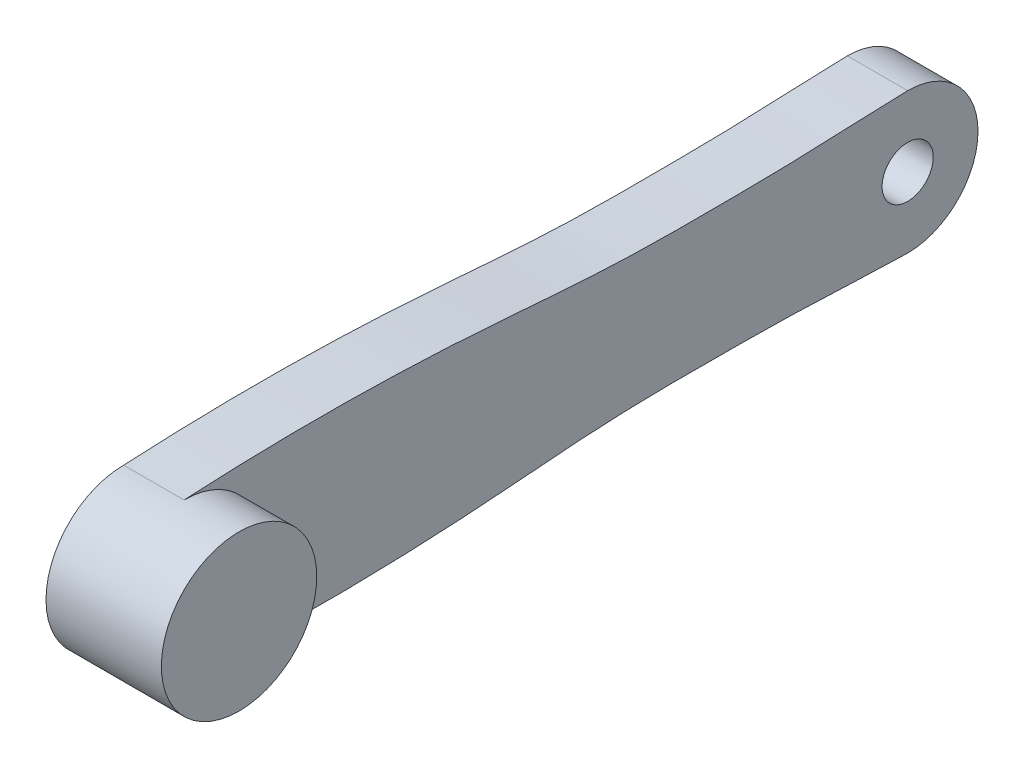
ISO-10303-21;
HEADER;
FILE_DESCRIPTION(('STEP AP214'),'2;1');
FILE_NAME('part.step','',(''),(''),'','','');
FILE_SCHEMA(('AUTOMOTIVE_DESIGN { 1 0 10303 214 1 1 1 1 }'));
ENDSEC;
DATA;
#1=APPLICATION_CONTEXT('core data for automotive mechanical design processes');
#2=APPLICATION_PROTOCOL_DEFINITION('international standard','automotive_design',2000,#1);
#3=PRODUCT_CONTEXT('',#1,'mechanical');
#4=PRODUCT('Part','Part','',(#3));
#5=PRODUCT_RELATED_PRODUCT_CATEGORY('part','',(#4));
#6=PRODUCT_DEFINITION_FORMATION('','',#4);
#7=PRODUCT_DEFINITION_CONTEXT('part definition',#1,'design');
#8=PRODUCT_DEFINITION('design','',#6,#7);
#9=PRODUCT_DEFINITION_SHAPE('','',#8);
#10=(LENGTH_UNIT() NAMED_UNIT(*) SI_UNIT(.MILLI.,.METRE.));
#11=(NAMED_UNIT(*) PLANE_ANGLE_UNIT() SI_UNIT($,.RADIAN.));
#12=(NAMED_UNIT(*) SI_UNIT($,.STERADIAN.) SOLID_ANGLE_UNIT());
#13=UNCERTAINTY_MEASURE_WITH_UNIT(LENGTH_MEASURE(1.E-05),#10,'distance_accuracy_value','');
#14=(GEOMETRIC_REPRESENTATION_CONTEXT(3) GLOBAL_UNCERTAINTY_ASSIGNED_CONTEXT((#13)) GLOBAL_UNIT_ASSIGNED_CONTEXT((#10,
#11,#12)) REPRESENTATION_CONTEXT('',''));
#15=CARTESIAN_POINT('',(0.,0.,0.));
#16=DIRECTION('',(0.,0.,1.));
#17=DIRECTION('',(1.,0.,0.));
#18=AXIS2_PLACEMENT_3D('',#15,#16,#17);
#19=CARTESIAN_POINT('',(0.,0.,-169.75));
#20=DIRECTION('',(-1.,0.,0.));
#21=DIRECTION('',(0.,0.,1.));
#22=AXIS2_PLACEMENT_3D('',#19,#20,#21);
#23=CYLINDRICAL_SURFACE('',#22,5.99999999999999);
#24=CARTESIAN_POINT('',(14.15,0.,-169.75));
#25=DIRECTION('',(-1.,0.,0.));
#26=DIRECTION('',(0.,0.,1.));
#27=AXIS2_PLACEMENT_3D('',#24,#25,#26);
#28=CIRCLE('',#27,5.99999999999999);
#29=CARTESIAN_POINT('',(14.15,0.,-163.75));
#30=VERTEX_POINT('',#29);
#31=EDGE_CURVE('E144',#30,#30,#28,.T.);
#32=ORIENTED_EDGE('',*,*,#31,.F.);
#33=EDGE_LOOP('',(#32));
#34=FACE_BOUND('',#33,.T.);
#35=CARTESIAN_POINT('',(2.5,0.,-169.75));
#36=DIRECTION('',(-1.,0.,0.));
#37=DIRECTION('',(0.,0.,1.));
#38=AXIS2_PLACEMENT_3D('',#35,#36,#37);
#39=CIRCLE('',#38,5.99999999999999);
#40=CARTESIAN_POINT('',(2.5,0.,-163.75));
#41=VERTEX_POINT('',#40);
#42=EDGE_CURVE('E40',#41,#41,#39,.F.);
#43=ORIENTED_EDGE('',*,*,#42,.F.);
#44=EDGE_LOOP('',(#43));
#45=FACE_BOUND('',#44,.T.);
#46=ADVANCED_FACE('F36',(#34,#45),#23,.F.);
#47=CARTESIAN_POINT('',(27.06,0.,0.));
#48=DIRECTION('',(-1.,0.,0.));
#49=DIRECTION('',(0.,0.,1.));
#50=AXIS2_PLACEMENT_3D('',#47,#48,#49);
#51=CYLINDRICAL_SURFACE('',#50,18.225);
#52=CARTESIAN_POINT('',(27.06,0.,0.));
#53=DIRECTION('',(1.,0.,0.));
#54=DIRECTION('',(0.,0.,-1.));
#55=AXIS2_PLACEMENT_3D('',#52,#53,#54);
#56=CIRCLE('',#55,18.225);
#57=CARTESIAN_POINT('',(27.06,0.,-18.225));
#58=VERTEX_POINT('',#57);
#59=EDGE_CURVE('E11',#58,#58,#56,.T.);
#60=ORIENTED_EDGE('',*,*,#59,.F.);
#61=EDGE_LOOP('',(#60));
#62=FACE_BOUND('',#61,.T.);
#63=CARTESIAN_POINT('',(14.15,0.,0.));
#64=DIRECTION('',(1.,0.,0.));
#65=DIRECTION('',(0.,0.,1.));
#66=AXIS2_PLACEMENT_3D('',#63,#64,#65);
#67=CIRCLE('',#66,18.225);
#68=CARTESIAN_POINT('',(14.15,-18.225,0.));
#69=VERTEX_POINT('',#68);
#70=CARTESIAN_POINT('',(14.15,18.225,-1.11013353549737E-09));
#71=VERTEX_POINT('',#70);
#72=EDGE_CURVE('E58',#69,#71,#67,.T.);
#73=ORIENTED_EDGE('',*,*,#72,.T.);
#74=DIRECTION('',(-1.,0.,0.));
#75=VECTOR('',#74,1.);
#76=CARTESIAN_POINT('',(14.15,18.225,-1.11013926366381E-09));
#77=LINE('',#76,#75);
#78=CARTESIAN_POINT('',(0.,18.225,-1.11013926366381E-09));
#79=VERTEX_POINT('',#78);
#80=EDGE_CURVE('E135',#71,#79,#77,.T.);
#81=ORIENTED_EDGE('',*,*,#80,.T.);
#82=CARTESIAN_POINT('',(0.,0.,0.));
#83=DIRECTION('',(1.,0.,0.));
#84=DIRECTION('',(0.,0.,-1.));
#85=AXIS2_PLACEMENT_3D('',#82,#83,#84);
#86=CIRCLE('',#85,18.225);
#87=CARTESIAN_POINT('',(0.,-18.225,0.));
#88=VERTEX_POINT('',#87);
#89=EDGE_CURVE('E45',#79,#88,#86,.T.);
#90=ORIENTED_EDGE('',*,*,#89,.T.);
#91=DIRECTION('',(-1.,0.,0.));
#92=VECTOR('',#91,1.);
#93=CARTESIAN_POINT('',(14.15,-18.225,0.));
#94=LINE('',#93,#92);
#95=EDGE_CURVE('E53',#69,#88,#94,.T.);
#96=ORIENTED_EDGE('',*,*,#95,.F.);
#97=EDGE_LOOP('',(#73,#81,#90,#96));
#98=FACE_BOUND('',#97,.T.);
#99=ADVANCED_FACE('F38',(#62,#98),#51,.T.);
#100=CARTESIAN_POINT('',(27.06,0.,0.));
#101=DIRECTION('',(1.,0.,0.));
#102=DIRECTION('',(0.,0.,-1.));
#103=AXIS2_PLACEMENT_3D('',#100,#101,#102);
#104=PLANE('',#103);
#105=ORIENTED_EDGE('',*,*,#59,.T.);
#106=EDGE_LOOP('',(#105));
#107=FACE_BOUND('',#106,.T.);
#108=ADVANCED_FACE('F185',(#107),#104,.T.);
#109=CARTESIAN_POINT('',(0.,0.,0.));
#110=DIRECTION('',(1.,0.,0.));
#111=DIRECTION('',(0.,0.,-1.));
#112=AXIS2_PLACEMENT_3D('',#109,#110,#111);
#113=PLANE('',#112);
#114=CARTESIAN_POINT('',(0.,0.,-169.75));
#115=DIRECTION('',(-1.,0.,0.));
#116=DIRECTION('',(0.,0.,1.));
#117=AXIS2_PLACEMENT_3D('',#114,#115,#116);
#118=CIRCLE('',#117,10.);
#119=CARTESIAN_POINT('',(0.,0.,-159.75));
#120=VERTEX_POINT('',#119);
#121=EDGE_CURVE('E303',#120,#120,#118,.T.);
#122=ORIENTED_EDGE('',*,*,#121,.F.);
#123=EDGE_LOOP('',(#122));
#124=FACE_BOUND('',#123,.T.);
#125=DIRECTION('',(0.,0.866025403784438,-0.5));
#126=VECTOR('',#125,1.);
#127=CARTESIAN_POINT('',(0.,0.,4.61880215351701));
#128=LINE('',#127,#126);
#129=CARTESIAN_POINT('',(0.,0.,4.61880215351701));
#130=VERTEX_POINT('',#129);
#131=CARTESIAN_POINT('',(0.,4.,2.3094010767585));
#132=VERTEX_POINT('',#131);
#133=EDGE_CURVE('E258',#130,#132,#128,.T.);
#134=ORIENTED_EDGE('',*,*,#133,.F.);
#135=DIRECTION('',(0.,0.866025403784439,0.5));
#136=VECTOR('',#135,1.);
#137=CARTESIAN_POINT('',(0.,-4.,2.3094010767585));
#138=LINE('',#137,#136);
#139=CARTESIAN_POINT('',(0.,-4.,2.3094010767585));
#140=VERTEX_POINT('',#139);
#141=EDGE_CURVE('E234',#140,#130,#138,.T.);
#142=ORIENTED_EDGE('',*,*,#141,.F.);
#143=DIRECTION('',(0.,0.,1.));
#144=VECTOR('',#143,1.);
#145=CARTESIAN_POINT('',(0.,-4.,-2.3094010767585));
#146=LINE('',#145,#144);
#147=CARTESIAN_POINT('',(0.,-4.,-2.3094010767585));
#148=VERTEX_POINT('',#147);
#149=EDGE_CURVE('E241',#148,#140,#146,.T.);
#150=ORIENTED_EDGE('',*,*,#149,.F.);
#151=DIRECTION('',(0.,-0.866025403784439,0.5));
#152=VECTOR('',#151,1.);
#153=CARTESIAN_POINT('',(0.,0.,-4.61880215351701));
#154=LINE('',#153,#152);
#155=CARTESIAN_POINT('',(0.,0.,-4.61880215351701));
#156=VERTEX_POINT('',#155);
#157=EDGE_CURVE('E267',#156,#148,#154,.T.);
#158=ORIENTED_EDGE('',*,*,#157,.F.);
#159=DIRECTION('',(0.,-0.866025403784439,-0.5));
#160=VECTOR('',#159,1.);
#161=CARTESIAN_POINT('',(0.,4.,-2.3094010767585));
#162=LINE('',#161,#160);
#163=CARTESIAN_POINT('',(0.,4.,-2.3094010767585));
#164=VERTEX_POINT('',#163);
#165=EDGE_CURVE('E264',#164,#156,#162,.T.);
#166=ORIENTED_EDGE('',*,*,#165,.F.);
#167=DIRECTION('',(0.,0.,-1.));
#168=VECTOR('',#167,1.);
#169=CARTESIAN_POINT('',(0.,4.,2.3094010767585));
#170=LINE('',#169,#168);
#171=EDGE_CURVE('E261',#132,#164,#170,.T.);
#172=ORIENTED_EDGE('',*,*,#171,.F.);
#173=EDGE_LOOP('',(#134,#142,#150,#158,#166,#172));
#174=FACE_BOUND('',#173,.T.);
#175=ORIENTED_EDGE('',*,*,#89,.F.);
#176=CARTESIAN_POINT('',(0.,18.225,-1.11013353549737E-09));
#177=CARTESIAN_POINT('',(0.,19.4874620186553,-23.2342693919419));
#178=CARTESIAN_POINT('',(0.,19.3330443565488,-56.5827604293317));
#179=CARTESIAN_POINT('',(0.,15.1468255186927,-99.7009370042646));
#180=CARTESIAN_POINT('',(0.,15.2407955833878,-123.084465671128));
#181=CARTESIAN_POINT('',(0.,15.4354663481788,-146.423041336121));
#182=CARTESIAN_POINT('',(0.,16.2703476300834,-159.749007011093));
#183=CARTESIAN_POINT('',(0.,16.5,-169.74999999889));
#184=B_SPLINE_CURVE_WITH_KNOTS('',3,(#176,#177,#178,#179,#180,#181,#182,#183),.UNSPECIFIED.,.F.,
.F.,(4,1,1,1,1,4),(0.,0.410781152391719,0.587817397240798,0.764423196787174,0.823292389326406,
1.),.UNSPECIFIED.);
#185=CARTESIAN_POINT('',(0.,16.5,-169.74999999889));
#186=VERTEX_POINT('',#185);
#187=EDGE_CURVE('E220',#79,#186,#184,.T.);
#188=ORIENTED_EDGE('',*,*,#187,.T.);
#189=CARTESIAN_POINT('',(0.,0.,-169.75));
#190=DIRECTION('',(-1.,0.,0.));
#191=DIRECTION('',(0.,0.,1.));
#192=AXIS2_PLACEMENT_3D('',#189,#190,#191);
#193=CIRCLE('',#192,16.5);
#194=CARTESIAN_POINT('',(0.,-16.5,-169.75));
#195=VERTEX_POINT('',#194);
#196=EDGE_CURVE('E120',#186,#195,#193,.T.);
#197=ORIENTED_EDGE('',*,*,#196,.T.);
#198=CARTESIAN_POINT('',(0.,-16.5,-169.75));
#199=CARTESIAN_POINT('',(0.,-16.270347630133,-159.749007011831));
#200=CARTESIAN_POINT('',(0.,-15.4354663481814,-146.423041336491));
#201=CARTESIAN_POINT('',(0.,-15.2407955833881,-123.084465671128));
#202=CARTESIAN_POINT('',(0.,-15.1468255186922,-99.7009370042646));
#203=CARTESIAN_POINT('',(0.,-19.3330443565871,-56.582760428963));
#204=CARTESIAN_POINT('',(0.,-19.4874620186463,-23.2342693912009));
#205=CARTESIAN_POINT('',(0.,-18.225,0.));
#206=B_SPLINE_CURVE_WITH_KNOTS('',3,(#198,#199,#200,#201,#202,#203,#204,#205),.UNSPECIFIED.,.F.,
.F.,(4,1,1,1,1,4),(0.,0.176707610677815,0.235576803216278,0.412182602760347,0.589218847607113,
1.),.UNSPECIFIED.);
#207=EDGE_CURVE('E136',#195,#88,#206,.T.);
#208=ORIENTED_EDGE('',*,*,#207,.T.);
#209=EDGE_LOOP('',(#175,#188,#197,#208));
#210=FACE_BOUND('',#209,.T.);
#211=ADVANCED_FACE('F183',(#124,#174,#210),#113,.F.);
#212=CARTESIAN_POINT('',(5.8,-4.,2.3094010767585));
#213=DIRECTION('',(0.,-0.5,0.866025403784439));
#214=DIRECTION('',(0.,-0.866025403784439,-0.5));
#215=AXIS2_PLACEMENT_3D('',#212,#213,#214);
#216=PLANE('',#215);
#217=ORIENTED_EDGE('',*,*,#141,.T.);
#218=DIRECTION('',(-1.,0.,0.));
#219=VECTOR('',#218,1.);
#220=CARTESIAN_POINT('',(5.8,0.,4.61880215351701));
#221=LINE('',#220,#219);
#222=CARTESIAN_POINT('',(5.8,0.,4.61880215351701));
#223=VERTEX_POINT('',#222);
#224=EDGE_CURVE('E256',#223,#130,#221,.T.);
#225=ORIENTED_EDGE('',*,*,#224,.F.);
#226=DIRECTION('',(0.,0.866025403784439,0.5));
#227=VECTOR('',#226,1.);
#228=CARTESIAN_POINT('',(5.8,-4.,2.3094010767585));
#229=LINE('',#228,#227);
#230=CARTESIAN_POINT('',(5.8,-4.,2.3094010767585));
#231=VERTEX_POINT('',#230);
#232=EDGE_CURVE('E237',#231,#223,#229,.T.);
#233=ORIENTED_EDGE('',*,*,#232,.F.);
#234=DIRECTION('',(-1.,0.,0.));
#235=VECTOR('',#234,1.);
#236=CARTESIAN_POINT('',(5.8,-4.,2.3094010767585));
#237=LINE('',#236,#235);
#238=EDGE_CURVE('E272',#231,#140,#237,.T.);
#239=ORIENTED_EDGE('',*,*,#238,.T.);
#240=EDGE_LOOP('',(#217,#225,#233,#239));
#241=FACE_BOUND('',#240,.T.);
#242=ADVANCED_FACE('F165',(#241),#216,.F.);
#243=CARTESIAN_POINT('',(5.8,-4.,-2.3094010767585));
#244=DIRECTION('',(0.,-1.,0.));
#245=DIRECTION('',(0.,0.,-1.));
#246=AXIS2_PLACEMENT_3D('',#243,#244,#245);
#247=PLANE('',#246);
#248=ORIENTED_EDGE('',*,*,#149,.T.);
#249=ORIENTED_EDGE('',*,*,#238,.F.);
#250=DIRECTION('',(0.,0.,1.));
#251=VECTOR('',#250,1.);
#252=CARTESIAN_POINT('',(5.8,-4.,-2.3094010767585));
#253=LINE('',#252,#251);
#254=CARTESIAN_POINT('',(5.8,-4.,-2.3094010767585));
#255=VERTEX_POINT('',#254);
#256=EDGE_CURVE('E253',#255,#231,#253,.T.);
#257=ORIENTED_EDGE('',*,*,#256,.F.);
#258=DIRECTION('',(-1.,0.,0.));
#259=VECTOR('',#258,1.);
#260=CARTESIAN_POINT('',(5.8,-4.,-2.3094010767585));
#261=LINE('',#260,#259);
#262=EDGE_CURVE('E274',#255,#148,#261,.T.);
#263=ORIENTED_EDGE('',*,*,#262,.T.);
#264=EDGE_LOOP('',(#248,#249,#257,#263));
#265=FACE_BOUND('',#264,.T.);
#266=ADVANCED_FACE('F161',(#265),#247,.F.);
#267=CARTESIAN_POINT('',(5.8,0.,-4.61880215351701));
#268=DIRECTION('',(0.,-0.5,-0.866025403784439));
#269=DIRECTION('',(0.,0.866025403784439,-0.5));
#270=AXIS2_PLACEMENT_3D('',#267,#268,#269);
#271=PLANE('',#270);
#272=ORIENTED_EDGE('',*,*,#157,.T.);
#273=ORIENTED_EDGE('',*,*,#262,.F.);
#274=DIRECTION('',(0.,-0.866025403784439,0.5));
#275=VECTOR('',#274,1.);
#276=CARTESIAN_POINT('',(5.8,0.,-4.61880215351701));
#277=LINE('',#276,#275);
#278=CARTESIAN_POINT('',(5.8,0.,-4.61880215351701));
#279=VERTEX_POINT('',#278);
#280=EDGE_CURVE('E250',#279,#255,#277,.T.);
#281=ORIENTED_EDGE('',*,*,#280,.F.);
#282=DIRECTION('',(-1.,0.,0.));
#283=VECTOR('',#282,1.);
#284=CARTESIAN_POINT('',(5.8,0.,-4.61880215351701));
#285=LINE('',#284,#283);
#286=EDGE_CURVE('E276',#279,#156,#285,.T.);
#287=ORIENTED_EDGE('',*,*,#286,.T.);
#288=EDGE_LOOP('',(#272,#273,#281,#287));
#289=FACE_BOUND('',#288,.T.);
#290=ADVANCED_FACE('F164',(#289),#271,.F.);
#291=CARTESIAN_POINT('',(5.8,4.,-2.3094010767585));
#292=DIRECTION('',(0.,0.5,-0.866025403784439));
#293=DIRECTION('',(0.,0.866025403784439,0.5));
#294=AXIS2_PLACEMENT_3D('',#291,#292,#293);
#295=PLANE('',#294);
#296=ORIENTED_EDGE('',*,*,#165,.T.);
#297=ORIENTED_EDGE('',*,*,#286,.F.);
#298=DIRECTION('',(0.,-0.866025403784439,-0.5));
#299=VECTOR('',#298,1.);
#300=CARTESIAN_POINT('',(5.8,4.,-2.3094010767585));
#301=LINE('',#300,#299);
#302=CARTESIAN_POINT('',(5.8,4.,-2.3094010767585));
#303=VERTEX_POINT('',#302);
#304=EDGE_CURVE('E247',#303,#279,#301,.T.);
#305=ORIENTED_EDGE('',*,*,#304,.F.);
#306=DIRECTION('',(-1.,0.,0.));
#307=VECTOR('',#306,1.);
#308=CARTESIAN_POINT('',(5.8,4.,-2.3094010767585));
#309=LINE('',#308,#307);
#310=EDGE_CURVE('E278',#303,#164,#309,.T.);
#311=ORIENTED_EDGE('',*,*,#310,.T.);
#312=EDGE_LOOP('',(#296,#297,#305,#311));
#313=FACE_BOUND('',#312,.T.);
#314=ADVANCED_FACE('F169',(#313),#295,.F.);
#315=CARTESIAN_POINT('',(5.8,4.,2.3094010767585));
#316=DIRECTION('',(0.,1.,0.));
#317=DIRECTION('',(0.,0.,1.));
#318=AXIS2_PLACEMENT_3D('',#315,#316,#317);
#319=PLANE('',#318);
#320=ORIENTED_EDGE('',*,*,#171,.T.);
#321=ORIENTED_EDGE('',*,*,#310,.F.);
#322=DIRECTION('',(0.,0.,-1.));
#323=VECTOR('',#322,1.);
#324=CARTESIAN_POINT('',(5.8,4.,2.3094010767585));
#325=LINE('',#324,#323);
#326=CARTESIAN_POINT('',(5.8,4.,2.3094010767585));
#327=VERTEX_POINT('',#326);
#328=EDGE_CURVE('E244',#327,#303,#325,.T.);
#329=ORIENTED_EDGE('',*,*,#328,.F.);
#330=DIRECTION('',(-1.,0.,0.));
#331=VECTOR('',#330,1.);
#332=CARTESIAN_POINT('',(5.8,4.,2.3094010767585));
#333=LINE('',#332,#331);
#334=EDGE_CURVE('E280',#327,#132,#333,.T.);
#335=ORIENTED_EDGE('',*,*,#334,.T.);
#336=EDGE_LOOP('',(#320,#321,#329,#335));
#337=FACE_BOUND('',#336,.T.);
#338=ADVANCED_FACE('F173',(#337),#319,.F.);
#339=CARTESIAN_POINT('',(5.8,0.,4.61880215351701));
#340=DIRECTION('',(0.,0.5,0.866025403784439));
#341=DIRECTION('',(0.,-0.866025403784439,0.5));
#342=AXIS2_PLACEMENT_3D('',#339,#340,#341);
#343=PLANE('',#342);
#344=ORIENTED_EDGE('',*,*,#133,.T.);
#345=ORIENTED_EDGE('',*,*,#334,.F.);
#346=DIRECTION('',(0.,0.866025403784438,-0.5));
#347=VECTOR('',#346,1.);
#348=CARTESIAN_POINT('',(5.8,0.,4.61880215351701));
#349=LINE('',#348,#347);
#350=EDGE_CURVE('E240',#223,#327,#349,.T.);
#351=ORIENTED_EDGE('',*,*,#350,.F.);
#352=ORIENTED_EDGE('',*,*,#224,.T.);
#353=EDGE_LOOP('',(#344,#345,#351,#352));
#354=FACE_BOUND('',#353,.T.);
#355=ADVANCED_FACE('F159',(#354),#343,.F.);
#356=CARTESIAN_POINT('',(5.8,0.,0.));
#357=DIRECTION('',(-1.,0.,0.));
#358=DIRECTION('',(0.,0.,1.));
#359=AXIS2_PLACEMENT_3D('',#356,#357,#358);
#360=PLANE('',#359);
#361=ORIENTED_EDGE('',*,*,#232,.T.);
#362=ORIENTED_EDGE('',*,*,#350,.T.);
#363=ORIENTED_EDGE('',*,*,#328,.T.);
#364=ORIENTED_EDGE('',*,*,#304,.T.);
#365=ORIENTED_EDGE('',*,*,#280,.T.);
#366=ORIENTED_EDGE('',*,*,#256,.T.);
#367=EDGE_LOOP('',(#361,#362,#363,#364,#365,#366));
#368=FACE_BOUND('',#367,.T.);
#369=ADVANCED_FACE('F155',(#368),#360,.T.);
#370=CARTESIAN_POINT('',(14.15,18.225,-1.11013353549737E-09));
#371=CARTESIAN_POINT('',(14.15,19.4874620186553,-23.2342693919419));
#372=CARTESIAN_POINT('',(14.15,19.3330443565488,-56.5827604293317));
#373=CARTESIAN_POINT('',(14.15,15.1468255186927,-99.7009370042646));
#374=CARTESIAN_POINT('',(14.15,15.2407955833878,-123.084465671128));
#375=CARTESIAN_POINT('',(14.15,15.4354663481788,-146.423041336121));
#376=CARTESIAN_POINT('',(14.15,16.2703476300834,-159.749007011093));
#377=CARTESIAN_POINT('',(14.15,16.5,-169.74999999889));
#378=B_SPLINE_CURVE_WITH_KNOTS('',3,(#370,#371,#372,#373,#374,#375,#376,#377),.UNSPECIFIED.,.F.,
.F.,(4,1,1,1,1,4),(0.,0.410781152391719,0.587817397240798,0.764423196787174,0.823292389326406,
1.),.UNSPECIFIED.);
#379=DIRECTION('',(-1.,0.,0.));
#380=VECTOR('',#379,1.);
#381=SURFACE_OF_LINEAR_EXTRUSION('',#378,#380);
#382=ORIENTED_EDGE('',*,*,#187,.F.);
#383=ORIENTED_EDGE('',*,*,#80,.F.);
#384=CARTESIAN_POINT('',(14.15,16.5,-169.74999999889));
#385=VERTEX_POINT('',#384);
#386=EDGE_CURVE('E131',#71,#385,#378,.T.);
#387=ORIENTED_EDGE('',*,*,#386,.T.);
#388=DIRECTION('',(-1.,0.,0.));
#389=VECTOR('',#388,1.);
#390=CARTESIAN_POINT('',(14.15,16.5,-169.74999999889));
#391=LINE('',#390,#389);
#392=EDGE_CURVE('E115',#385,#186,#391,.T.);
#393=ORIENTED_EDGE('',*,*,#392,.T.);
#394=EDGE_LOOP('',(#382,#383,#387,#393));
#395=FACE_BOUND('',#394,.T.);
#396=ADVANCED_FACE('F134',(#395),#381,.T.);
#397=CARTESIAN_POINT('',(14.15,-16.5,-169.75));
#398=CARTESIAN_POINT('',(14.15,-16.270347630133,-159.749007011831));
#399=CARTESIAN_POINT('',(14.15,-15.4354663481814,-146.423041336491));
#400=CARTESIAN_POINT('',(14.15,-15.2407955833881,-123.084465671128));
#401=CARTESIAN_POINT('',(14.15,-15.1468255186922,-99.7009370042646));
#402=CARTESIAN_POINT('',(14.15,-19.3330443565871,-56.582760428963));
#403=CARTESIAN_POINT('',(14.15,-19.4874620186463,-23.2342693912009));
#404=CARTESIAN_POINT('',(14.15,-18.225,0.));
#405=B_SPLINE_CURVE_WITH_KNOTS('',3,(#397,#398,#399,#400,#401,#402,#403,#404),.UNSPECIFIED.,.F.,
.F.,(4,1,1,1,1,4),(0.,0.176707610677815,0.235576803216278,0.412182602760347,0.589218847607113,
1.),.UNSPECIFIED.);
#406=DIRECTION('',(-1.,0.,0.));
#407=VECTOR('',#406,1.);
#408=SURFACE_OF_LINEAR_EXTRUSION('',#405,#407);
#409=ORIENTED_EDGE('',*,*,#207,.F.);
#410=DIRECTION('',(-1.,0.,0.));
#411=VECTOR('',#410,1.);
#412=CARTESIAN_POINT('',(14.15,-16.5,-169.75));
#413=LINE('',#412,#411);
#414=CARTESIAN_POINT('',(14.15,-16.5,-169.75));
#415=VERTEX_POINT('',#414);
#416=EDGE_CURVE('E125',#415,#195,#413,.T.);
#417=ORIENTED_EDGE('',*,*,#416,.F.);
#418=EDGE_CURVE('E132',#415,#69,#405,.T.);
#419=ORIENTED_EDGE('',*,*,#418,.T.);
#420=ORIENTED_EDGE('',*,*,#95,.T.);
#421=EDGE_LOOP('',(#409,#417,#419,#420));
#422=FACE_BOUND('',#421,.T.);
#423=ADVANCED_FACE('F154',(#422),#408,.T.);
#424=CARTESIAN_POINT('',(14.15,0.,-169.75));
#425=DIRECTION('',(-1.,0.,0.));
#426=DIRECTION('',(0.,0.,1.));
#427=AXIS2_PLACEMENT_3D('',#424,#425,#426);
#428=CYLINDRICAL_SURFACE('',#427,16.5);
#429=ORIENTED_EDGE('',*,*,#196,.F.);
#430=ORIENTED_EDGE('',*,*,#392,.F.);
#431=CARTESIAN_POINT('',(14.15,0.,-169.75));
#432=DIRECTION('',(-1.,0.,0.));
#433=DIRECTION('',(0.,0.,1.));
#434=AXIS2_PLACEMENT_3D('',#431,#432,#433);
#435=CIRCLE('',#434,16.5);
#436=EDGE_CURVE('E118',#385,#415,#435,.T.);
#437=ORIENTED_EDGE('',*,*,#436,.T.);
#438=ORIENTED_EDGE('',*,*,#416,.T.);
#439=EDGE_LOOP('',(#429,#430,#437,#438));
#440=FACE_BOUND('',#439,.T.);
#441=ADVANCED_FACE('F117',(#440),#428,.T.);
#442=CARTESIAN_POINT('',(14.15,16.6179889928397,-84.8659372165607));
#443=DIRECTION('',(-1.,0.,0.));
#444=DIRECTION('',(0.,0.,1.));
#445=AXIS2_PLACEMENT_3D('',#442,#443,#444);
#446=PLANE('',#445);
#447=ORIENTED_EDGE('',*,*,#31,.T.);
#448=EDGE_LOOP('',(#447));
#449=FACE_BOUND('',#448,.T.);
#450=ORIENTED_EDGE('',*,*,#386,.F.);
#451=ORIENTED_EDGE('',*,*,#72,.F.);
#452=ORIENTED_EDGE('',*,*,#418,.F.);
#453=ORIENTED_EDGE('',*,*,#436,.F.);
#454=EDGE_LOOP('',(#450,#451,#452,#453));
#455=FACE_BOUND('',#454,.T.);
#456=ADVANCED_FACE('F130',(#449,#455),#446,.F.);
#457=CARTESIAN_POINT('',(2.5,0.,-169.75));
#458=DIRECTION('',(-1.,0.,0.));
#459=DIRECTION('',(0.,0.,1.));
#460=AXIS2_PLACEMENT_3D('',#457,#458,#459);
#461=PLANE('',#460);
#462=CARTESIAN_POINT('',(2.5,0.,-169.75));
#463=DIRECTION('',(-1.,0.,0.));
#464=DIRECTION('',(0.,0.,1.));
#465=AXIS2_PLACEMENT_3D('',#462,#463,#464);
#466=CIRCLE('',#465,10.);
#467=CARTESIAN_POINT('',(2.5,0.,-159.75));
#468=VERTEX_POINT('',#467);
#469=EDGE_CURVE('E299',#468,#468,#466,.T.);
#470=ORIENTED_EDGE('',*,*,#469,.T.);
#471=EDGE_LOOP('',(#470));
#472=FACE_BOUND('',#471,.T.);
#473=ORIENTED_EDGE('',*,*,#42,.T.);
#474=EDGE_LOOP('',(#473));
#475=FACE_BOUND('',#474,.T.);
#476=ADVANCED_FACE('F208',(#472,#475),#461,.T.);
#477=CARTESIAN_POINT('',(2.5,0.,-169.75));
#478=DIRECTION('',(-1.,0.,0.));
#479=DIRECTION('',(0.,0.,1.));
#480=AXIS2_PLACEMENT_3D('',#477,#478,#479);
#481=CYLINDRICAL_SURFACE('',#480,10.);
#482=ORIENTED_EDGE('',*,*,#469,.F.);
#483=EDGE_LOOP('',(#482));
#484=FACE_BOUND('',#483,.T.);
#485=ORIENTED_EDGE('',*,*,#121,.T.);
#486=EDGE_LOOP('',(#485));
#487=FACE_BOUND('',#486,.T.);
#488=ADVANCED_FACE('F205',(#484,#487),#481,.F.);
#489=CLOSED_SHELL('',(#46,#99,#108,#211,#242,#266,#290,#314,#338,#355,#369,#396,#423,#441,#456,
#476,#488));
#490=MANIFOLD_SOLID_BREP('B2',#489);
#491=ADVANCED_BREP_SHAPE_REPRESENTATION('',(#18,#490),#14);
#492=SHAPE_DEFINITION_REPRESENTATION(#9,#491);
ENDSEC;
END-ISO-10303-21;
